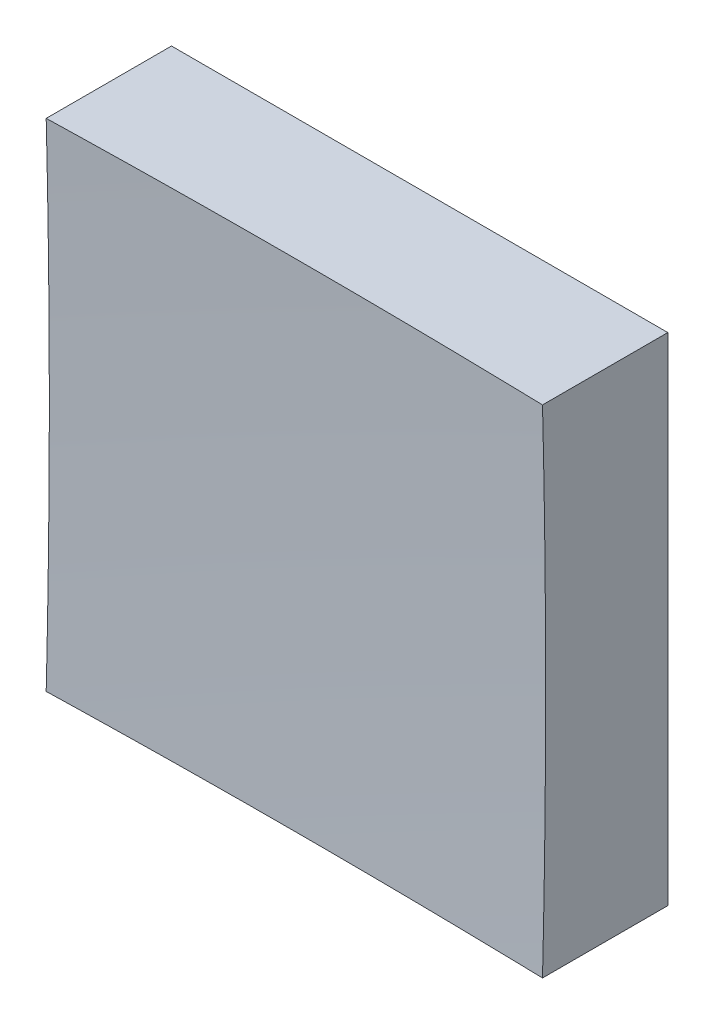
ISO-10303-21;
HEADER;
FILE_DESCRIPTION(('STEP AP214'),'2;1');
FILE_NAME('part.step','',(''),(''),'','','');
FILE_SCHEMA(('AUTOMOTIVE_DESIGN { 1 0 10303 214 1 1 1 1 }'));
ENDSEC;
DATA;
#1=APPLICATION_CONTEXT('core data for automotive mechanical design processes');
#2=APPLICATION_PROTOCOL_DEFINITION('international standard','automotive_design',2000,#1);
#3=PRODUCT_CONTEXT('',#1,'mechanical');
#4=PRODUCT('Part','Part','',(#3));
#5=PRODUCT_RELATED_PRODUCT_CATEGORY('part','',(#4));
#6=PRODUCT_DEFINITION_FORMATION('','',#4);
#7=PRODUCT_DEFINITION_CONTEXT('part definition',#1,'design');
#8=PRODUCT_DEFINITION('design','',#6,#7);
#9=PRODUCT_DEFINITION_SHAPE('','',#8);
#10=(LENGTH_UNIT() NAMED_UNIT(*) SI_UNIT(.MILLI.,.METRE.));
#11=(NAMED_UNIT(*) PLANE_ANGLE_UNIT() SI_UNIT($,.RADIAN.));
#12=(NAMED_UNIT(*) SI_UNIT($,.STERADIAN.) SOLID_ANGLE_UNIT());
#13=UNCERTAINTY_MEASURE_WITH_UNIT(LENGTH_MEASURE(1.E-05),#10,'distance_accuracy_value','');
#14=(GEOMETRIC_REPRESENTATION_CONTEXT(3) GLOBAL_UNCERTAINTY_ASSIGNED_CONTEXT((#13)) GLOBAL_UNIT_ASSIGNED_CONTEXT((#10,
#11,#12)) REPRESENTATION_CONTEXT('',''));
#15=CARTESIAN_POINT('',(0.,0.,0.));
#16=DIRECTION('',(0.,0.,1.));
#17=DIRECTION('',(1.,0.,0.));
#18=AXIS2_PLACEMENT_3D('',#15,#16,#17);
#19=CARTESIAN_POINT('',(-12.5,12.5,20.));
#20=DIRECTION('',(0.,1.,0.));
#21=DIRECTION('',(0.,0.,1.));
#22=AXIS2_PLACEMENT_3D('',#19,#20,#21);
#23=PLANE('',#22);
#24=CARTESIAN_POINT('',(0.,12.5,506.));
#25=DIRECTION('',(0.,1.,0.));
#26=DIRECTION('',(0.,0.,1.));
#27=AXIS2_PLACEMENT_3D('',#24,#25,#26);
#28=CIRCLE('',#27,499.843725578305);
#29=CARTESIAN_POINT('',(12.5,12.5,6.31259771733284));
#30=VERTEX_POINT('',#29);
#31=CARTESIAN_POINT('',(-12.5,12.5,6.31259771733284));
#32=VERTEX_POINT('',#31);
#33=EDGE_CURVE('E79',#30,#32,#28,.T.);
#34=ORIENTED_EDGE('',*,*,#33,.F.);
#35=DIRECTION('',(0.,0.,-1.));
#36=VECTOR('',#35,1.);
#37=CARTESIAN_POINT('',(12.5,12.5,20.));
#38=LINE('',#37,#36);
#39=CARTESIAN_POINT('',(12.5,12.5,0.));
#40=VERTEX_POINT('',#39);
#41=EDGE_CURVE('E85',#30,#40,#38,.T.);
#42=ORIENTED_EDGE('',*,*,#41,.T.);
#43=DIRECTION('',(1.,0.,0.));
#44=VECTOR('',#43,1.);
#45=CARTESIAN_POINT('',(-12.5,12.5,0.));
#46=LINE('',#45,#44);
#47=CARTESIAN_POINT('',(-12.5,12.5,0.));
#48=VERTEX_POINT('',#47);
#49=EDGE_CURVE('E88',#48,#40,#46,.T.);
#50=ORIENTED_EDGE('',*,*,#49,.F.);
#51=DIRECTION('',(0.,0.,-1.));
#52=VECTOR('',#51,1.);
#53=CARTESIAN_POINT('',(-12.5,12.5,20.));
#54=LINE('',#53,#52);
#55=EDGE_CURVE('E47',#32,#48,#54,.T.);
#56=ORIENTED_EDGE('',*,*,#55,.F.);
#57=EDGE_LOOP('',(#34,#42,#50,#56));
#58=FACE_BOUND('',#57,.T.);
#59=ADVANCED_FACE('F39',(#58),#23,.T.);
#60=CARTESIAN_POINT('',(-12.5,12.5,20.));
#61=DIRECTION('',(1.,0.,0.));
#62=DIRECTION('',(0.,1.,0.));
#63=AXIS2_PLACEMENT_3D('',#60,#61,#62);
#64=PLANE('',#63);
#65=DIRECTION('',(0.,0.,-1.));
#66=VECTOR('',#65,1.);
#67=CARTESIAN_POINT('',(-12.5,-12.5,20.));
#68=LINE('',#67,#66);
#69=CARTESIAN_POINT('',(-12.5,-12.5,6.31259771733284));
#70=VERTEX_POINT('',#69);
#71=CARTESIAN_POINT('',(-12.5,-12.5,0.));
#72=VERTEX_POINT('',#71);
#73=EDGE_CURVE('E100',#70,#72,#68,.T.);
#74=ORIENTED_EDGE('',*,*,#73,.F.);
#75=CARTESIAN_POINT('',(-12.5,0.,506.));
#76=DIRECTION('',(1.,0.,0.));
#77=DIRECTION('',(0.,1.,0.));
#78=AXIS2_PLACEMENT_3D('',#75,#76,#77);
#79=CIRCLE('',#78,499.843725578305);
#80=EDGE_CURVE('E89',#70,#32,#79,.T.);
#81=ORIENTED_EDGE('',*,*,#80,.T.);
#82=ORIENTED_EDGE('',*,*,#55,.T.);
#83=DIRECTION('',(0.,-1.,0.));
#84=VECTOR('',#83,1.);
#85=CARTESIAN_POINT('',(-12.5,12.5,0.));
#86=LINE('',#85,#84);
#87=EDGE_CURVE('E97',#48,#72,#86,.T.);
#88=ORIENTED_EDGE('',*,*,#87,.T.);
#89=EDGE_LOOP('',(#74,#81,#82,#88));
#90=FACE_BOUND('',#89,.T.);
#91=ADVANCED_FACE('F122',(#90),#64,.F.);
#92=CARTESIAN_POINT('',(-12.5,-12.5,20.));
#93=DIRECTION('',(0.,1.,0.));
#94=DIRECTION('',(0.,0.,1.));
#95=AXIS2_PLACEMENT_3D('',#92,#93,#94);
#96=PLANE('',#95);
#97=DIRECTION('',(0.,0.,-1.));
#98=VECTOR('',#97,1.);
#99=CARTESIAN_POINT('',(12.5,-12.5,20.));
#100=LINE('',#99,#98);
#101=CARTESIAN_POINT('',(12.5,-12.5,6.31259771733284));
#102=VERTEX_POINT('',#101);
#103=CARTESIAN_POINT('',(12.5,-12.5,0.));
#104=VERTEX_POINT('',#103);
#105=EDGE_CURVE('E96',#102,#104,#100,.T.);
#106=ORIENTED_EDGE('',*,*,#105,.F.);
#107=CARTESIAN_POINT('',(0.,-12.5,506.));
#108=DIRECTION('',(0.,1.,0.));
#109=DIRECTION('',(0.,0.,1.));
#110=AXIS2_PLACEMENT_3D('',#107,#108,#109);
#111=CIRCLE('',#110,499.843725578305);
#112=EDGE_CURVE('E53',#102,#70,#111,.T.);
#113=ORIENTED_EDGE('',*,*,#112,.T.);
#114=ORIENTED_EDGE('',*,*,#73,.T.);
#115=DIRECTION('',(1.,0.,0.));
#116=VECTOR('',#115,1.);
#117=CARTESIAN_POINT('',(-12.5,-12.5,0.));
#118=LINE('',#117,#116);
#119=EDGE_CURVE('E102',#72,#104,#118,.T.);
#120=ORIENTED_EDGE('',*,*,#119,.T.);
#121=EDGE_LOOP('',(#106,#113,#114,#120));
#122=FACE_BOUND('',#121,.T.);
#123=ADVANCED_FACE('F121',(#122),#96,.F.);
#124=CARTESIAN_POINT('',(12.5,12.5,20.));
#125=DIRECTION('',(1.,0.,0.));
#126=DIRECTION('',(0.,1.,0.));
#127=AXIS2_PLACEMENT_3D('',#124,#125,#126);
#128=PLANE('',#127);
#129=CARTESIAN_POINT('',(12.5,0.,506.));
#130=DIRECTION('',(1.,0.,0.));
#131=DIRECTION('',(0.,1.,0.));
#132=AXIS2_PLACEMENT_3D('',#129,#130,#131);
#133=CIRCLE('',#132,499.843725578305);
#134=EDGE_CURVE('E11',#102,#30,#133,.T.);
#135=ORIENTED_EDGE('',*,*,#134,.F.);
#136=ORIENTED_EDGE('',*,*,#105,.T.);
#137=DIRECTION('',(0.,-1.,0.));
#138=VECTOR('',#137,1.);
#139=CARTESIAN_POINT('',(12.5,12.5,0.));
#140=LINE('',#139,#138);
#141=EDGE_CURVE('E93',#40,#104,#140,.T.);
#142=ORIENTED_EDGE('',*,*,#141,.F.);
#143=ORIENTED_EDGE('',*,*,#41,.F.);
#144=EDGE_LOOP('',(#135,#136,#142,#143));
#145=FACE_BOUND('',#144,.T.);
#146=ADVANCED_FACE('F91',(#145),#128,.T.);
#147=CARTESIAN_POINT('',(0.,0.,0.));
#148=DIRECTION('',(0.,0.,-1.));
#149=DIRECTION('',(-1.,0.,0.));
#150=AXIS2_PLACEMENT_3D('',#147,#148,#149);
#151=PLANE('',#150);
#152=ORIENTED_EDGE('',*,*,#49,.T.);
#153=ORIENTED_EDGE('',*,*,#141,.T.);
#154=ORIENTED_EDGE('',*,*,#119,.F.);
#155=ORIENTED_EDGE('',*,*,#87,.F.);
#156=EDGE_LOOP('',(#152,#153,#154,#155));
#157=FACE_BOUND('',#156,.T.);
#158=ADVANCED_FACE('F125',(#157),#151,.T.);
#159=CARTESIAN_POINT('',(0.,0.,506.));
#160=DIRECTION('',(0.,0.,1.));
#161=DIRECTION('',(1.,0.,0.));
#162=AXIS2_PLACEMENT_3D('',#159,#160,#161);
#163=SPHERICAL_SURFACE('',#162,500.);
#164=ORIENTED_EDGE('',*,*,#33,.T.);
#165=ORIENTED_EDGE('',*,*,#80,.F.);
#166=ORIENTED_EDGE('',*,*,#112,.F.);
#167=ORIENTED_EDGE('',*,*,#134,.T.);
#168=EDGE_LOOP('',(#164,#165,#166,#167));
#169=FACE_BOUND('',#168,.T.);
#170=ADVANCED_FACE('F78',(#169),#163,.F.);
#171=CLOSED_SHELL('',(#59,#91,#123,#146,#158,#170));
#172=MANIFOLD_SOLID_BREP('B2',#171);
#173=ADVANCED_BREP_SHAPE_REPRESENTATION('',(#18,#172),#14);
#174=SHAPE_DEFINITION_REPRESENTATION(#9,#173);
ENDSEC;
END-ISO-10303-21;
